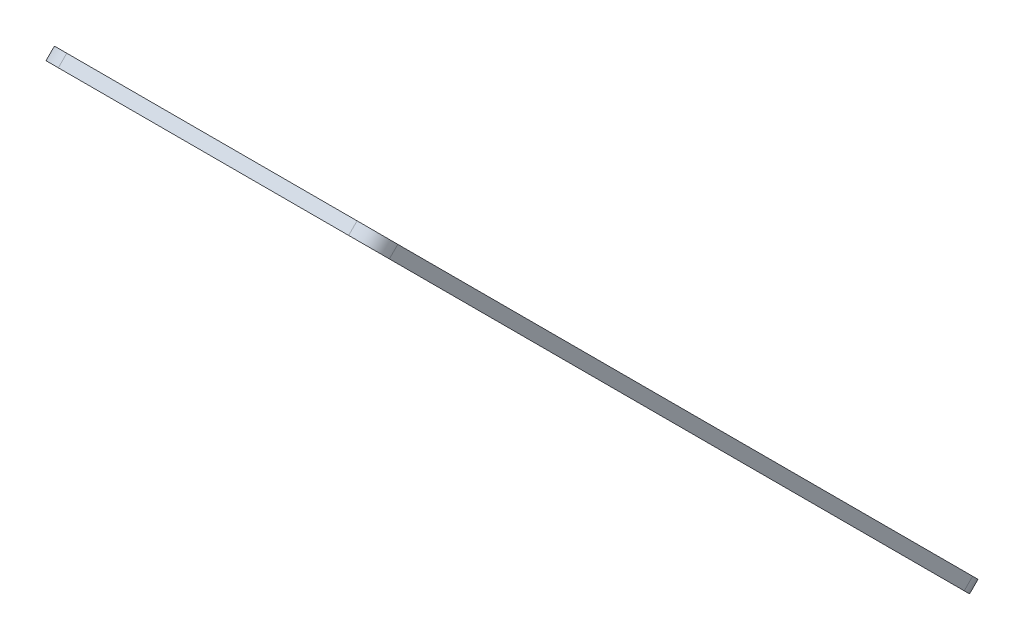
ISO-10303-21;
HEADER;
FILE_DESCRIPTION(('STEP AP214'),'2;1');
FILE_NAME('part.step','',(''),(''),'','','');
FILE_SCHEMA(('AUTOMOTIVE_DESIGN { 1 0 10303 214 1 1 1 1 }'));
ENDSEC;
DATA;
#1=APPLICATION_CONTEXT('core data for automotive mechanical design processes');
#2=APPLICATION_PROTOCOL_DEFINITION('international standard','automotive_design',2000,#1);
#3=PRODUCT_CONTEXT('',#1,'mechanical');
#4=PRODUCT('Part','Part','',(#3));
#5=PRODUCT_RELATED_PRODUCT_CATEGORY('part','',(#4));
#6=PRODUCT_DEFINITION_FORMATION('','',#4);
#7=PRODUCT_DEFINITION_CONTEXT('part definition',#1,'design');
#8=PRODUCT_DEFINITION('design','',#6,#7);
#9=PRODUCT_DEFINITION_SHAPE('','',#8);
#10=(LENGTH_UNIT() NAMED_UNIT(*) SI_UNIT(.MILLI.,.METRE.));
#11=(NAMED_UNIT(*) PLANE_ANGLE_UNIT() SI_UNIT($,.RADIAN.));
#12=(NAMED_UNIT(*) SI_UNIT($,.STERADIAN.) SOLID_ANGLE_UNIT());
#13=UNCERTAINTY_MEASURE_WITH_UNIT(LENGTH_MEASURE(1.E-05),#10,'distance_accuracy_value','');
#14=(GEOMETRIC_REPRESENTATION_CONTEXT(3) GLOBAL_UNCERTAINTY_ASSIGNED_CONTEXT((#13)) GLOBAL_UNIT_ASSIGNED_CONTEXT((#10,
#11,#12)) REPRESENTATION_CONTEXT('',''));
#15=CARTESIAN_POINT('',(0.,0.,0.));
#16=DIRECTION('',(0.,0.,1.));
#17=DIRECTION('',(1.,0.,0.));
#18=AXIS2_PLACEMENT_3D('',#15,#16,#17);
#19=CARTESIAN_POINT('',(51.6500000000002,78.4734705798789,460.544538391746));
#20=DIRECTION('',(0.,0.707106781186544,-0.707106781186551));
#21=DIRECTION('',(0.,0.707106781186551,0.707106781186544));
#22=AXIS2_PLACEMENT_3D('',#19,#20,#21);
#23=PLANE('',#22);
#24=CARTESIAN_POINT('',(51.6500000000002,78.4734705798789,460.544538391746));
#25=DIRECTION('',(0.,-0.707106781186544,0.707106781186551));
#26=DIRECTION('',(0.,0.707106781186551,0.707106781186544));
#27=AXIS2_PLACEMENT_3D('',#24,#25,#26);
#28=CIRCLE('',#27,10.);
#29=CARTESIAN_POINT('',(41.6500000000002,78.4734705798789,460.544538391746));
#30=VERTEX_POINT('',#29);
#31=CARTESIAN_POINT('',(51.6500000000002,71.4024027680134,453.473470579881));
#32=VERTEX_POINT('',#31);
#33=EDGE_CURVE('E165',#30,#32,#28,.T.);
#34=ORIENTED_EDGE('',*,*,#33,.T.);
#35=DIRECTION('',(1.,0.,0.));
#36=VECTOR('',#35,1.);
#37=CARTESIAN_POINT('',(51.6500000000002,71.4024027680134,453.473470579881));
#38=LINE('',#37,#36);
#39=CARTESIAN_POINT('',(173.35,71.4024027680136,453.473470579881));
#40=VERTEX_POINT('',#39);
#41=EDGE_CURVE('E100',#32,#40,#38,.T.);
#42=ORIENTED_EDGE('',*,*,#41,.T.);
#43=CARTESIAN_POINT('',(173.35,78.4734705798791,460.544538391746));
#44=DIRECTION('',(0.,-0.707106781186544,0.707106781186551));
#45=DIRECTION('',(0.,-0.707106781186551,-0.707106781186544));
#46=AXIS2_PLACEMENT_3D('',#43,#44,#45);
#47=CIRCLE('',#46,9.99999999999997);
#48=CARTESIAN_POINT('',(183.35,78.4734705798791,460.544538391746));
#49=VERTEX_POINT('',#48);
#50=EDGE_CURVE('E187',#40,#49,#47,.T.);
#51=ORIENTED_EDGE('',*,*,#50,.T.);
#52=DIRECTION('',(0.,0.707106781186551,0.707106781186544));
#53=VECTOR('',#52,1.);
#54=CARTESIAN_POINT('',(183.35,78.4734705798791,460.544538391746));
#55=LINE('',#54,#53);
#56=CARTESIAN_POINT('',(183.35,319.455461608256,701.52652942012));
#57=VERTEX_POINT('',#56);
#58=EDGE_CURVE('E201',#49,#57,#55,.T.);
#59=ORIENTED_EDGE('',*,*,#58,.T.);
#60=CARTESIAN_POINT('',(173.35,319.455461608256,701.52652942012));
#61=DIRECTION('',(0.,-0.707106781186544,0.707106781186551));
#62=DIRECTION('',(0.,0.707106781186551,0.707106781186544));
#63=AXIS2_PLACEMENT_3D('',#60,#61,#62);
#64=CIRCLE('',#63,10.0000000000001);
#65=CARTESIAN_POINT('',(173.35,326.526529420121,708.597597231986));
#66=VERTEX_POINT('',#65);
#67=EDGE_CURVE('E119',#57,#66,#64,.T.);
#68=ORIENTED_EDGE('',*,*,#67,.T.);
#69=DIRECTION('',(-1.,0.,0.));
#70=VECTOR('',#69,1.);
#71=CARTESIAN_POINT('',(51.65,326.526529420121,708.597597231986));
#72=LINE('',#71,#70);
#73=CARTESIAN_POINT('',(51.65,326.526529420121,708.597597231986));
#74=VERTEX_POINT('',#73);
#75=EDGE_CURVE('E113',#66,#74,#72,.T.);
#76=ORIENTED_EDGE('',*,*,#75,.T.);
#77=CARTESIAN_POINT('',(51.65,319.455461608256,701.52652942012));
#78=DIRECTION('',(0.,-0.707106781186544,0.707106781186551));
#79=DIRECTION('',(0.,0.707106781186551,0.707106781186544));
#80=AXIS2_PLACEMENT_3D('',#77,#78,#79);
#81=CIRCLE('',#80,10.0000000000001);
#82=CARTESIAN_POINT('',(41.6499999999999,319.455461608256,701.52652942012));
#83=VERTEX_POINT('',#82);
#84=EDGE_CURVE('E117',#74,#83,#81,.T.);
#85=ORIENTED_EDGE('',*,*,#84,.T.);
#86=DIRECTION('',(0.,-0.707106781186551,-0.707106781186544));
#87=VECTOR('',#86,1.);
#88=CARTESIAN_POINT('',(41.6500000000002,78.4734705798789,460.544538391746));
#89=LINE('',#88,#87);
#90=EDGE_CURVE('E57',#83,#30,#89,.T.);
#91=ORIENTED_EDGE('',*,*,#90,.T.);
#92=EDGE_LOOP('',(#34,#42,#51,#59,#68,#76,#85,#91));
#93=FACE_BOUND('',#92,.T.);
#94=CARTESIAN_POINT('',(170.,310.333784130949,692.404851942814));
#95=DIRECTION('',(0.,-0.707106781186544,0.707106781186551));
#96=DIRECTION('',(0.,-0.707106781186551,-0.707106781186544));
#97=AXIS2_PLACEMENT_3D('',#94,#95,#96);
#98=CIRCLE('',#97,2.7);
#99=CARTESIAN_POINT('',(170.,308.424595821746,690.49566363361));
#100=VERTEX_POINT('',#99);
#101=EDGE_CURVE('E147',#100,#100,#98,.T.);
#102=ORIENTED_EDGE('',*,*,#101,.F.);
#103=EDGE_LOOP('',(#102));
#104=FACE_BOUND('',#103,.T.);
#105=CARTESIAN_POINT('',(55.,310.333784130949,692.404851942814));
#106=DIRECTION('',(0.,-0.707106781186544,0.707106781186551));
#107=DIRECTION('',(0.,-0.707106781186551,-0.707106781186544));
#108=AXIS2_PLACEMENT_3D('',#105,#106,#107);
#109=CIRCLE('',#108,2.7);
#110=CARTESIAN_POINT('',(55.,308.424595821745,690.49566363361));
#111=VERTEX_POINT('',#110);
#112=EDGE_CURVE('E216',#111,#111,#109,.T.);
#113=ORIENTED_EDGE('',*,*,#112,.F.);
#114=EDGE_LOOP('',(#113));
#115=FACE_BOUND('',#114,.T.);
#116=CARTESIAN_POINT('',(170.,87.5951480571856,469.666215869053));
#117=DIRECTION('',(0.,-0.707106781186544,0.707106781186551));
#118=DIRECTION('',(0.,-0.707106781186551,-0.707106781186544));
#119=AXIS2_PLACEMENT_3D('',#116,#117,#118);
#120=CIRCLE('',#119,2.70000000000001);
#121=CARTESIAN_POINT('',(170.,85.6859597479819,467.757027559849));
#122=VERTEX_POINT('',#121);
#123=EDGE_CURVE('E224',#122,#122,#120,.T.);
#124=ORIENTED_EDGE('',*,*,#123,.F.);
#125=EDGE_LOOP('',(#124));
#126=FACE_BOUND('',#125,.T.);
#127=CARTESIAN_POINT('',(55.0000000000002,87.5951480571854,469.666215869053));
#128=DIRECTION('',(0.,-0.707106781186544,0.707106781186551));
#129=DIRECTION('',(0.,-0.707106781186551,-0.707106781186544));
#130=AXIS2_PLACEMENT_3D('',#127,#128,#129);
#131=CIRCLE('',#130,2.69999999999998);
#132=CARTESIAN_POINT('',(55.0000000000002,85.6859597479818,467.757027559849));
#133=VERTEX_POINT('',#132);
#134=EDGE_CURVE('E232',#133,#133,#131,.T.);
#135=ORIENTED_EDGE('',*,*,#134,.F.);
#136=EDGE_LOOP('',(#135));
#137=FACE_BOUND('',#136,.T.);
#138=ADVANCED_FACE('F39',(#93,#104,#115,#126,#137),#23,.F.);
#139=CARTESIAN_POINT('',(51.6500000000002,82.0090044858116,457.009004485813));
#140=DIRECTION('',(0.,0.707106781186544,-0.707106781186551));
#141=DIRECTION('',(0.,0.707106781186551,0.707106781186544));
#142=AXIS2_PLACEMENT_3D('',#139,#140,#141);
#143=PLANE('',#142);
#144=CARTESIAN_POINT('',(170.,91.1306819631183,466.13068196312));
#145=DIRECTION('',(0.,-0.707106781186544,0.707106781186551));
#146=DIRECTION('',(0.,-0.707106781186551,-0.707106781186544));
#147=AXIS2_PLACEMENT_3D('',#144,#145,#146);
#148=CIRCLE('',#147,2.70000000000001);
#149=CARTESIAN_POINT('',(170.,89.2214936539146,464.221493653916));
#150=VERTEX_POINT('',#149);
#151=EDGE_CURVE('E228',#150,#150,#148,.T.);
#152=ORIENTED_EDGE('',*,*,#151,.T.);
#153=EDGE_LOOP('',(#152));
#154=FACE_BOUND('',#153,.T.);
#155=CARTESIAN_POINT('',(170.,313.869318036882,688.869318036881));
#156=DIRECTION('',(0.,-0.707106781186544,0.707106781186551));
#157=DIRECTION('',(0.,-0.707106781186551,-0.707106781186544));
#158=AXIS2_PLACEMENT_3D('',#155,#156,#157);
#159=CIRCLE('',#158,2.7);
#160=CARTESIAN_POINT('',(170.,311.960129727678,686.960129727677));
#161=VERTEX_POINT('',#160);
#162=EDGE_CURVE('E212',#161,#161,#159,.T.);
#163=ORIENTED_EDGE('',*,*,#162,.T.);
#164=EDGE_LOOP('',(#163));
#165=FACE_BOUND('',#164,.T.);
#166=CARTESIAN_POINT('',(51.6500000000002,82.0090044858116,457.009004485813));
#167=DIRECTION('',(0.,-0.707106781186544,0.707106781186551));
#168=DIRECTION('',(0.,0.707106781186551,0.707106781186544));
#169=AXIS2_PLACEMENT_3D('',#166,#167,#168);
#170=CIRCLE('',#169,10.);
#171=CARTESIAN_POINT('',(41.6500000000002,82.0090044858116,457.009004485813));
#172=VERTEX_POINT('',#171);
#173=CARTESIAN_POINT('',(51.6500000000002,74.9379366739461,449.937936673948));
#174=VERTEX_POINT('',#173);
#175=EDGE_CURVE('E142',#172,#174,#170,.T.);
#176=ORIENTED_EDGE('',*,*,#175,.F.);
#177=DIRECTION('',(0.,-0.707106781186551,-0.707106781186544));
#178=VECTOR('',#177,1.);
#179=CARTESIAN_POINT('',(41.6500000000002,82.0090044858116,457.009004485813));
#180=LINE('',#179,#178);
#181=CARTESIAN_POINT('',(41.6499999999999,322.990995514188,697.990995514188));
#182=VERTEX_POINT('',#181);
#183=EDGE_CURVE('E92',#182,#172,#180,.T.);
#184=ORIENTED_EDGE('',*,*,#183,.F.);
#185=CARTESIAN_POINT('',(51.65,322.990995514188,697.990995514187));
#186=DIRECTION('',(0.,-0.707106781186544,0.707106781186551));
#187=DIRECTION('',(0.,0.707106781186551,0.707106781186544));
#188=AXIS2_PLACEMENT_3D('',#185,#186,#187);
#189=CIRCLE('',#188,10.0000000000001);
#190=CARTESIAN_POINT('',(51.65,330.062063326054,705.062063326053));
#191=VERTEX_POINT('',#190);
#192=EDGE_CURVE('E86',#191,#182,#189,.T.);
#193=ORIENTED_EDGE('',*,*,#192,.F.);
#194=DIRECTION('',(-1.,0.,0.));
#195=VECTOR('',#194,1.);
#196=CARTESIAN_POINT('',(51.65,330.062063326054,705.062063326053));
#197=LINE('',#196,#195);
#198=CARTESIAN_POINT('',(173.35,330.062063326054,705.062063326053));
#199=VERTEX_POINT('',#198);
#200=EDGE_CURVE('E128',#199,#191,#197,.T.);
#201=ORIENTED_EDGE('',*,*,#200,.F.);
#202=CARTESIAN_POINT('',(173.35,322.990995514188,697.990995514187));
#203=DIRECTION('',(0.,-0.707106781186544,0.707106781186551));
#204=DIRECTION('',(0.,0.707106781186551,0.707106781186544));
#205=AXIS2_PLACEMENT_3D('',#202,#203,#204);
#206=CIRCLE('',#205,10.0000000000001);
#207=CARTESIAN_POINT('',(183.35,322.990995514188,697.990995514187));
#208=VERTEX_POINT('',#207);
#209=EDGE_CURVE('E156',#208,#199,#206,.T.);
#210=ORIENTED_EDGE('',*,*,#209,.F.);
#211=DIRECTION('',(0.,0.707106781186551,0.707106781186544));
#212=VECTOR('',#211,1.);
#213=CARTESIAN_POINT('',(183.35,82.0090044858118,457.009004485813));
#214=LINE('',#213,#212);
#215=CARTESIAN_POINT('',(183.35,82.0090044858118,457.009004485813));
#216=VERTEX_POINT('',#215);
#217=EDGE_CURVE('E153',#216,#208,#214,.T.);
#218=ORIENTED_EDGE('',*,*,#217,.F.);
#219=CARTESIAN_POINT('',(173.35,82.0090044858118,457.009004485813));
#220=DIRECTION('',(0.,-0.707106781186544,0.707106781186551));
#221=DIRECTION('',(0.,-0.707106781186551,-0.707106781186544));
#222=AXIS2_PLACEMENT_3D('',#219,#220,#221);
#223=CIRCLE('',#222,9.99999999999997);
#224=CARTESIAN_POINT('',(173.35,74.9379366739464,449.937936673948));
#225=VERTEX_POINT('',#224);
#226=EDGE_CURVE('E150',#225,#216,#223,.T.);
#227=ORIENTED_EDGE('',*,*,#226,.F.);
#228=DIRECTION('',(1.,0.,0.));
#229=VECTOR('',#228,1.);
#230=CARTESIAN_POINT('',(51.6500000000002,74.9379366739461,449.937936673948));
#231=LINE('',#230,#229);
#232=EDGE_CURVE('E146',#174,#225,#231,.T.);
#233=ORIENTED_EDGE('',*,*,#232,.F.);
#234=EDGE_LOOP('',(#176,#184,#193,#201,#210,#218,#227,#233));
#235=FACE_BOUND('',#234,.T.);
#236=CARTESIAN_POINT('',(55.,313.869318036882,688.869318036881));
#237=DIRECTION('',(0.,-0.707106781186544,0.707106781186551));
#238=DIRECTION('',(0.,-0.707106781186551,-0.707106781186544));
#239=AXIS2_PLACEMENT_3D('',#236,#237,#238);
#240=CIRCLE('',#239,2.7);
#241=CARTESIAN_POINT('',(55.,311.960129727678,686.960129727677));
#242=VERTEX_POINT('',#241);
#243=EDGE_CURVE('E220',#242,#242,#240,.T.);
#244=ORIENTED_EDGE('',*,*,#243,.T.);
#245=EDGE_LOOP('',(#244));
#246=FACE_BOUND('',#245,.T.);
#247=CARTESIAN_POINT('',(55.0000000000002,91.1306819631182,466.13068196312));
#248=DIRECTION('',(0.,-0.707106781186544,0.707106781186551));
#249=DIRECTION('',(0.,-0.707106781186551,-0.707106781186544));
#250=AXIS2_PLACEMENT_3D('',#247,#248,#249);
#251=CIRCLE('',#250,2.69999999999998);
#252=CARTESIAN_POINT('',(55.0000000000002,89.2214936539145,464.221493653916));
#253=VERTEX_POINT('',#252);
#254=EDGE_CURVE('E236',#253,#253,#251,.T.);
#255=ORIENTED_EDGE('',*,*,#254,.T.);
#256=EDGE_LOOP('',(#255));
#257=FACE_BOUND('',#256,.T.);
#258=ADVANCED_FACE('F191',(#154,#165,#235,#246,#257),#143,.T.);
#259=CARTESIAN_POINT('',(51.6500000000002,78.4734705798789,460.544538391746));
#260=DIRECTION('',(0.,0.707106781186544,-0.707106781186551));
#261=DIRECTION('',(0.,0.707106781186551,0.707106781186544));
#262=AXIS2_PLACEMENT_3D('',#259,#260,#261);
#263=CYLINDRICAL_SURFACE('',#262,10.);
#264=ORIENTED_EDGE('',*,*,#175,.T.);
#265=DIRECTION('',(0.,0.707106781186544,-0.707106781186551));
#266=VECTOR('',#265,1.);
#267=CARTESIAN_POINT('',(51.6500000000002,71.4024027680134,453.473470579881));
#268=LINE('',#267,#266);
#269=EDGE_CURVE('E11',#32,#174,#268,.T.);
#270=ORIENTED_EDGE('',*,*,#269,.F.);
#271=ORIENTED_EDGE('',*,*,#33,.F.);
#272=DIRECTION('',(0.,0.707106781186544,-0.707106781186551));
#273=VECTOR('',#272,1.);
#274=CARTESIAN_POINT('',(41.6500000000002,78.4734705798789,460.544538391746));
#275=LINE('',#274,#273);
#276=EDGE_CURVE('E138',#30,#172,#275,.T.);
#277=ORIENTED_EDGE('',*,*,#276,.T.);
#278=EDGE_LOOP('',(#264,#270,#271,#277));
#279=FACE_BOUND('',#278,.T.);
#280=ADVANCED_FACE('F41',(#279),#263,.T.);
#281=CARTESIAN_POINT('',(51.6500000000002,71.4024027680134,453.473470579881));
#282=DIRECTION('',(0.,0.707106781186551,0.707106781186544));
#283=DIRECTION('',(0.,-0.707106781186544,0.707106781186551));
#284=AXIS2_PLACEMENT_3D('',#281,#282,#283);
#285=PLANE('',#284);
#286=ORIENTED_EDGE('',*,*,#232,.T.);
#287=DIRECTION('',(0.,0.707106781186544,-0.707106781186551));
#288=VECTOR('',#287,1.);
#289=CARTESIAN_POINT('',(173.35,71.4024027680136,453.473470579881));
#290=LINE('',#289,#288);
#291=EDGE_CURVE('E49',#40,#225,#290,.T.);
#292=ORIENTED_EDGE('',*,*,#291,.F.);
#293=ORIENTED_EDGE('',*,*,#41,.F.);
#294=ORIENTED_EDGE('',*,*,#269,.T.);
#295=EDGE_LOOP('',(#286,#292,#293,#294));
#296=FACE_BOUND('',#295,.T.);
#297=ADVANCED_FACE('F271',(#296),#285,.F.);
#298=CARTESIAN_POINT('',(173.35,78.4734705798791,460.544538391746));
#299=DIRECTION('',(0.,0.707106781186544,-0.707106781186551));
#300=DIRECTION('',(0.,0.707106781186551,0.707106781186544));
#301=AXIS2_PLACEMENT_3D('',#298,#299,#300);
#302=CYLINDRICAL_SURFACE('',#301,9.99999999999997);
#303=ORIENTED_EDGE('',*,*,#226,.T.);
#304=DIRECTION('',(0.,0.707106781186544,-0.707106781186551));
#305=VECTOR('',#304,1.);
#306=CARTESIAN_POINT('',(183.35,78.4734705798791,460.544538391746));
#307=LINE('',#306,#305);
#308=EDGE_CURVE('E176',#49,#216,#307,.T.);
#309=ORIENTED_EDGE('',*,*,#308,.F.);
#310=ORIENTED_EDGE('',*,*,#50,.F.);
#311=ORIENTED_EDGE('',*,*,#291,.T.);
#312=EDGE_LOOP('',(#303,#309,#310,#311));
#313=FACE_BOUND('',#312,.T.);
#314=ADVANCED_FACE('F185',(#313),#302,.T.);
#315=CARTESIAN_POINT('',(183.35,78.4734705798791,460.544538391746));
#316=DIRECTION('',(-1.,0.,0.));
#317=DIRECTION('',(0.,-1.,0.));
#318=AXIS2_PLACEMENT_3D('',#315,#316,#317);
#319=PLANE('',#318);
#320=ORIENTED_EDGE('',*,*,#217,.T.);
#321=DIRECTION('',(0.,0.707106781186544,-0.707106781186551));
#322=VECTOR('',#321,1.);
#323=CARTESIAN_POINT('',(183.35,319.455461608256,701.52652942012));
#324=LINE('',#323,#322);
#325=EDGE_CURVE('E172',#57,#208,#324,.T.);
#326=ORIENTED_EDGE('',*,*,#325,.F.);
#327=ORIENTED_EDGE('',*,*,#58,.F.);
#328=ORIENTED_EDGE('',*,*,#308,.T.);
#329=EDGE_LOOP('',(#320,#326,#327,#328));
#330=FACE_BOUND('',#329,.T.);
#331=ADVANCED_FACE('F196',(#330),#319,.F.);
#332=CARTESIAN_POINT('',(173.35,319.455461608256,701.52652942012));
#333=DIRECTION('',(0.,0.707106781186544,-0.707106781186551));
#334=DIRECTION('',(0.,0.707106781186551,0.707106781186544));
#335=AXIS2_PLACEMENT_3D('',#332,#333,#334);
#336=CYLINDRICAL_SURFACE('',#335,10.0000000000001);
#337=ORIENTED_EDGE('',*,*,#209,.T.);
#338=DIRECTION('',(0.,0.707106781186544,-0.707106781186551));
#339=VECTOR('',#338,1.);
#340=CARTESIAN_POINT('',(173.35,326.526529420121,708.597597231986));
#341=LINE('',#340,#339);
#342=EDGE_CURVE('E130',#66,#199,#341,.T.);
#343=ORIENTED_EDGE('',*,*,#342,.F.);
#344=ORIENTED_EDGE('',*,*,#67,.F.);
#345=ORIENTED_EDGE('',*,*,#325,.T.);
#346=EDGE_LOOP('',(#337,#343,#344,#345));
#347=FACE_BOUND('',#346,.T.);
#348=ADVANCED_FACE('F199',(#347),#336,.T.);
#349=CARTESIAN_POINT('',(51.65,326.526529420121,708.597597231986));
#350=DIRECTION('',(0.,-0.707106781186551,-0.707106781186544));
#351=DIRECTION('',(0.,0.707106781186544,-0.707106781186551));
#352=AXIS2_PLACEMENT_3D('',#349,#350,#351);
#353=PLANE('',#352);
#354=ORIENTED_EDGE('',*,*,#200,.T.);
#355=DIRECTION('',(0.,0.707106781186544,-0.707106781186551));
#356=VECTOR('',#355,1.);
#357=CARTESIAN_POINT('',(51.65,326.526529420121,708.597597231986));
#358=LINE('',#357,#356);
#359=EDGE_CURVE('E125',#74,#191,#358,.T.);
#360=ORIENTED_EDGE('',*,*,#359,.F.);
#361=ORIENTED_EDGE('',*,*,#75,.F.);
#362=ORIENTED_EDGE('',*,*,#342,.T.);
#363=EDGE_LOOP('',(#354,#360,#361,#362));
#364=FACE_BOUND('',#363,.T.);
#365=ADVANCED_FACE('F126',(#364),#353,.F.);
#366=CARTESIAN_POINT('',(51.65,319.455461608256,701.52652942012));
#367=DIRECTION('',(0.,0.707106781186544,-0.707106781186551));
#368=DIRECTION('',(0.,0.707106781186551,0.707106781186544));
#369=AXIS2_PLACEMENT_3D('',#366,#367,#368);
#370=CYLINDRICAL_SURFACE('',#369,10.0000000000001);
#371=ORIENTED_EDGE('',*,*,#192,.T.);
#372=DIRECTION('',(0.,0.707106781186544,-0.707106781186551));
#373=VECTOR('',#372,1.);
#374=CARTESIAN_POINT('',(41.6499999999999,319.455461608256,701.52652942012));
#375=LINE('',#374,#373);
#376=EDGE_CURVE('E131',#83,#182,#375,.T.);
#377=ORIENTED_EDGE('',*,*,#376,.F.);
#378=ORIENTED_EDGE('',*,*,#84,.F.);
#379=ORIENTED_EDGE('',*,*,#359,.T.);
#380=EDGE_LOOP('',(#371,#377,#378,#379));
#381=FACE_BOUND('',#380,.T.);
#382=ADVANCED_FACE('F133',(#381),#370,.T.);
#383=CARTESIAN_POINT('',(41.6500000000002,78.4734705798789,460.544538391746));
#384=DIRECTION('',(1.,0.,0.));
#385=DIRECTION('',(0.,1.,0.));
#386=AXIS2_PLACEMENT_3D('',#383,#384,#385);
#387=PLANE('',#386);
#388=ORIENTED_EDGE('',*,*,#183,.T.);
#389=ORIENTED_EDGE('',*,*,#276,.F.);
#390=ORIENTED_EDGE('',*,*,#90,.F.);
#391=ORIENTED_EDGE('',*,*,#376,.T.);
#392=EDGE_LOOP('',(#388,#389,#390,#391));
#393=FACE_BOUND('',#392,.T.);
#394=ADVANCED_FACE('F259',(#393),#387,.F.);
#395=CARTESIAN_POINT('',(170.,310.333784130949,692.404851942814));
#396=DIRECTION('',(0.,0.707106781186544,-0.707106781186551));
#397=DIRECTION('',(0.,0.707106781186551,0.707106781186544));
#398=AXIS2_PLACEMENT_3D('',#395,#396,#397);
#399=CYLINDRICAL_SURFACE('',#398,2.7);
#400=ORIENTED_EDGE('',*,*,#101,.T.);
#401=EDGE_LOOP('',(#400));
#402=FACE_BOUND('',#401,.T.);
#403=ORIENTED_EDGE('',*,*,#162,.F.);
#404=EDGE_LOOP('',(#403));
#405=FACE_BOUND('',#404,.T.);
#406=ADVANCED_FACE('F256',(#402,#405),#399,.F.);
#407=CARTESIAN_POINT('',(55.,310.333784130949,692.404851942814));
#408=DIRECTION('',(0.,0.707106781186544,-0.707106781186551));
#409=DIRECTION('',(0.,0.707106781186551,0.707106781186544));
#410=AXIS2_PLACEMENT_3D('',#407,#408,#409);
#411=CYLINDRICAL_SURFACE('',#410,2.7);
#412=ORIENTED_EDGE('',*,*,#112,.T.);
#413=EDGE_LOOP('',(#412));
#414=FACE_BOUND('',#413,.T.);
#415=ORIENTED_EDGE('',*,*,#243,.F.);
#416=EDGE_LOOP('',(#415));
#417=FACE_BOUND('',#416,.T.);
#418=ADVANCED_FACE('F361',(#414,#417),#411,.F.);
#419=CARTESIAN_POINT('',(170.,87.5951480571856,469.666215869053));
#420=DIRECTION('',(0.,0.707106781186544,-0.707106781186551));
#421=DIRECTION('',(0.,0.707106781186551,0.707106781186544));
#422=AXIS2_PLACEMENT_3D('',#419,#420,#421);
#423=CYLINDRICAL_SURFACE('',#422,2.70000000000001);
#424=ORIENTED_EDGE('',*,*,#123,.T.);
#425=EDGE_LOOP('',(#424));
#426=FACE_BOUND('',#425,.T.);
#427=ORIENTED_EDGE('',*,*,#151,.F.);
#428=EDGE_LOOP('',(#427));
#429=FACE_BOUND('',#428,.T.);
#430=ADVANCED_FACE('F371',(#426,#429),#423,.F.);
#431=CARTESIAN_POINT('',(55.0000000000002,87.5951480571854,469.666215869053));
#432=DIRECTION('',(0.,0.707106781186544,-0.707106781186551));
#433=DIRECTION('',(0.,0.707106781186551,0.707106781186544));
#434=AXIS2_PLACEMENT_3D('',#431,#432,#433);
#435=CYLINDRICAL_SURFACE('',#434,2.69999999999998);
#436=ORIENTED_EDGE('',*,*,#134,.T.);
#437=EDGE_LOOP('',(#436));
#438=FACE_BOUND('',#437,.T.);
#439=ORIENTED_EDGE('',*,*,#254,.F.);
#440=EDGE_LOOP('',(#439));
#441=FACE_BOUND('',#440,.T.);
#442=ADVANCED_FACE('F245',(#438,#441),#435,.F.);
#443=CLOSED_SHELL('',(#138,#258,#280,#297,#314,#331,#348,#365,#382,#394,#406,#418,#430,#442));
#444=MANIFOLD_SOLID_BREP('B2',#443);
#445=ADVANCED_BREP_SHAPE_REPRESENTATION('',(#18,#444),#14);
#446=SHAPE_DEFINITION_REPRESENTATION(#9,#445);
ENDSEC;
END-ISO-10303-21;
